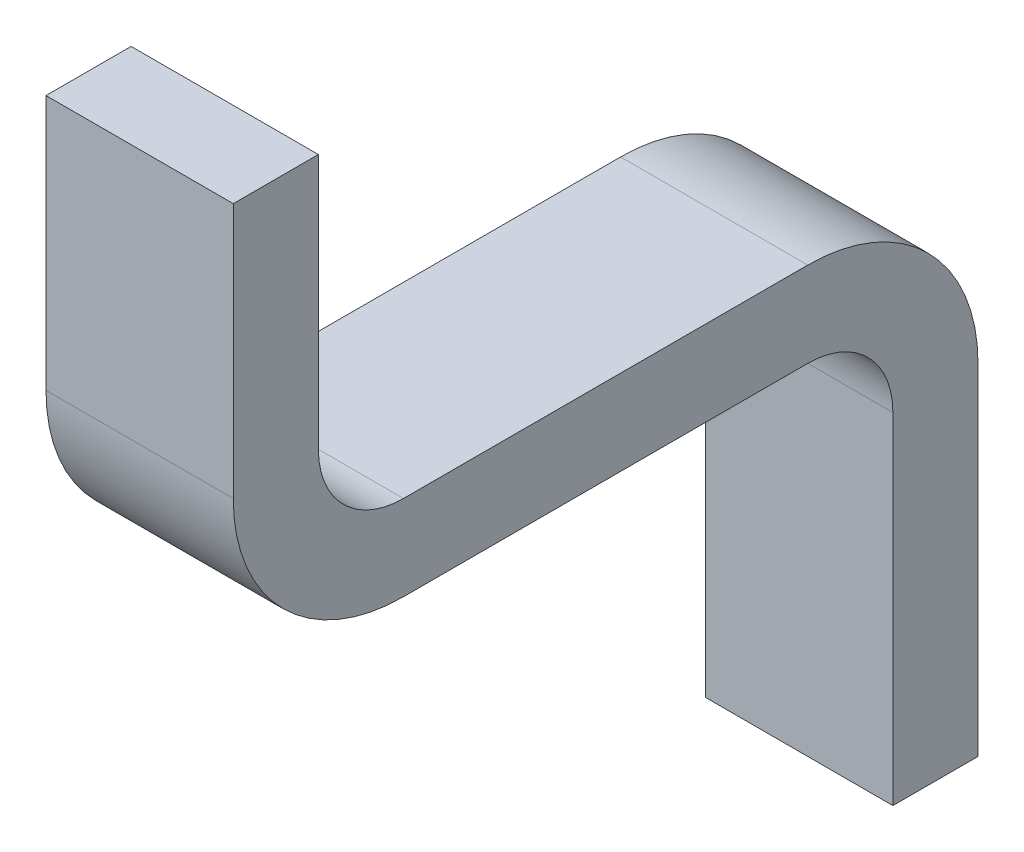
ISO-10303-21;
HEADER;
FILE_DESCRIPTION(('STEP AP214'),'2;1');
FILE_NAME('part.step','',(''),(''),'','','');
FILE_SCHEMA(('AUTOMOTIVE_DESIGN { 1 0 10303 214 1 1 1 1 }'));
ENDSEC;
DATA;
#1=APPLICATION_CONTEXT('core data for automotive mechanical design processes');
#2=APPLICATION_PROTOCOL_DEFINITION('international standard','automotive_design',2000,#1);
#3=PRODUCT_CONTEXT('',#1,'mechanical');
#4=PRODUCT('Part','Part','',(#3));
#5=PRODUCT_RELATED_PRODUCT_CATEGORY('part','',(#4));
#6=PRODUCT_DEFINITION_FORMATION('','',#4);
#7=PRODUCT_DEFINITION_CONTEXT('part definition',#1,'design');
#8=PRODUCT_DEFINITION('design','',#6,#7);
#9=PRODUCT_DEFINITION_SHAPE('','',#8);
#10=(LENGTH_UNIT() NAMED_UNIT(*) SI_UNIT(.MILLI.,.METRE.));
#11=(NAMED_UNIT(*) PLANE_ANGLE_UNIT() SI_UNIT($,.RADIAN.));
#12=(NAMED_UNIT(*) SI_UNIT($,.STERADIAN.) SOLID_ANGLE_UNIT());
#13=UNCERTAINTY_MEASURE_WITH_UNIT(LENGTH_MEASURE(1.E-05),#10,'distance_accuracy_value','');
#14=(GEOMETRIC_REPRESENTATION_CONTEXT(3) GLOBAL_UNCERTAINTY_ASSIGNED_CONTEXT((#13)) GLOBAL_UNIT_ASSIGNED_CONTEXT((#10,
#11,#12)) REPRESENTATION_CONTEXT('',''));
#15=CARTESIAN_POINT('',(0.,0.,0.));
#16=DIRECTION('',(0.,0.,1.));
#17=DIRECTION('',(1.,0.,0.));
#18=AXIS2_PLACEMENT_3D('',#15,#16,#17);
#19=CARTESIAN_POINT('',(-2.86,-4.,0.675));
#20=DIRECTION('',(1.,0.,0.));
#21=DIRECTION('',(0.,1.,0.));
#22=AXIS2_PLACEMENT_3D('',#19,#20,#21);
#23=PLANE('',#22);
#24=CARTESIAN_POINT('',(-2.86,-3.8,0.675));
#25=DIRECTION('',(-1.,0.,0.));
#26=DIRECTION('',(0.,-1.,0.));
#27=AXIS2_PLACEMENT_3D('',#24,#25,#26);
#28=CIRCLE('',#27,0.2);
#29=CARTESIAN_POINT('',(-2.86,-3.8,0.875));
#30=VERTEX_POINT('',#29);
#31=CARTESIAN_POINT('',(-2.86,-4.,0.675));
#32=VERTEX_POINT('',#31);
#33=EDGE_CURVE('E150',#30,#32,#28,.F.);
#34=ORIENTED_EDGE('',*,*,#33,.F.);
#35=DIRECTION('',(0.,1.,0.));
#36=VECTOR('',#35,1.);
#37=CARTESIAN_POINT('',(-2.86,-3.5,0.875));
#38=LINE('',#37,#36);
#39=CARTESIAN_POINT('',(-2.86,-3.5,0.875));
#40=VERTEX_POINT('',#39);
#41=EDGE_CURVE('E147',#30,#40,#38,.T.);
#42=ORIENTED_EDGE('',*,*,#41,.T.);
#43=DIRECTION('',(0.,0.,1.));
#44=VECTOR('',#43,1.);
#45=CARTESIAN_POINT('',(-2.86,-3.5,0.775));
#46=LINE('',#45,#44);
#47=CARTESIAN_POINT('',(-2.86,-3.5,0.775));
#48=VERTEX_POINT('',#47);
#49=EDGE_CURVE('E141',#48,#40,#46,.T.);
#50=ORIENTED_EDGE('',*,*,#49,.F.);
#51=DIRECTION('',(0.,1.,0.));
#52=VECTOR('',#51,1.);
#53=CARTESIAN_POINT('',(-2.86,-3.5,0.775));
#54=LINE('',#53,#52);
#55=CARTESIAN_POINT('',(-2.86,-3.8,0.775));
#56=VERTEX_POINT('',#55);
#57=EDGE_CURVE('E115',#48,#56,#54,.F.);
#58=ORIENTED_EDGE('',*,*,#57,.T.);
#59=CARTESIAN_POINT('',(-2.86,-3.8,0.675));
#60=DIRECTION('',(-1.,0.,0.));
#61=DIRECTION('',(0.,-1.,0.));
#62=AXIS2_PLACEMENT_3D('',#59,#60,#61);
#63=CIRCLE('',#62,0.1);
#64=CARTESIAN_POINT('',(-2.86,-3.9,0.675));
#65=VERTEX_POINT('',#64);
#66=EDGE_CURVE('E215',#56,#65,#63,.F.);
#67=ORIENTED_EDGE('',*,*,#66,.T.);
#68=DIRECTION('',(0.,0.,1.));
#69=VECTOR('',#68,1.);
#70=CARTESIAN_POINT('',(-2.86,-3.9,0.675));
#71=LINE('',#70,#69);
#72=CARTESIAN_POINT('',(-2.86,-3.9,0.2));
#73=VERTEX_POINT('',#72);
#74=EDGE_CURVE('E181',#65,#73,#71,.F.);
#75=ORIENTED_EDGE('',*,*,#74,.T.);
#76=CARTESIAN_POINT('',(-2.86,-4.1,0.2));
#77=DIRECTION('',(1.,0.,0.));
#78=DIRECTION('',(0.,1.,0.));
#79=AXIS2_PLACEMENT_3D('',#76,#77,#78);
#80=CIRCLE('',#79,0.2);
#81=CARTESIAN_POINT('',(-2.86,-4.1,0.));
#82=VERTEX_POINT('',#81);
#83=EDGE_CURVE('E20',#82,#73,#80,.T.);
#84=ORIENTED_EDGE('',*,*,#83,.F.);
#85=DIRECTION('',(0.,1.,0.));
#86=VECTOR('',#85,1.);
#87=CARTESIAN_POINT('',(-2.86,-4.1,0.));
#88=LINE('',#87,#86);
#89=CARTESIAN_POINT('',(-2.86,-4.5,0.));
#90=VERTEX_POINT('',#89);
#91=EDGE_CURVE('E91',#82,#90,#88,.F.);
#92=ORIENTED_EDGE('',*,*,#91,.T.);
#93=DIRECTION('',(0.,0.,1.));
#94=VECTOR('',#93,1.);
#95=CARTESIAN_POINT('',(-2.86,-4.5,0.));
#96=LINE('',#95,#94);
#97=CARTESIAN_POINT('',(-2.86,-4.5,0.1));
#98=VERTEX_POINT('',#97);
#99=EDGE_CURVE('E163',#90,#98,#96,.T.);
#100=ORIENTED_EDGE('',*,*,#99,.T.);
#101=DIRECTION('',(0.,1.,0.));
#102=VECTOR('',#101,1.);
#103=CARTESIAN_POINT('',(-2.86,-4.1,0.1));
#104=LINE('',#103,#102);
#105=CARTESIAN_POINT('',(-2.86,-4.1,0.1));
#106=VERTEX_POINT('',#105);
#107=EDGE_CURVE('E159',#98,#106,#104,.T.);
#108=ORIENTED_EDGE('',*,*,#107,.T.);
#109=CARTESIAN_POINT('',(-2.86,-4.1,0.2));
#110=DIRECTION('',(1.,0.,0.));
#111=DIRECTION('',(0.,1.,0.));
#112=AXIS2_PLACEMENT_3D('',#109,#110,#111);
#113=CIRCLE('',#112,0.1);
#114=CARTESIAN_POINT('',(-2.86,-4.,0.2));
#115=VERTEX_POINT('',#114);
#116=EDGE_CURVE('E155',#106,#115,#113,.T.);
#117=ORIENTED_EDGE('',*,*,#116,.T.);
#118=DIRECTION('',(0.,0.,1.));
#119=VECTOR('',#118,1.);
#120=CARTESIAN_POINT('',(-2.86,-4.,0.675));
#121=LINE('',#120,#119);
#122=EDGE_CURVE('E154',#115,#32,#121,.T.);
#123=ORIENTED_EDGE('',*,*,#122,.T.);
#124=EDGE_LOOP('',(#34,#42,#50,#58,#67,#75,#84,#92,#100,#108,#117,#123));
#125=FACE_BOUND('',#124,.T.);
#126=ADVANCED_FACE('F17',(#125),#23,.F.);
#127=CARTESIAN_POINT('',(-2.86,-4.1,0.2));
#128=DIRECTION('',(1.,0.,0.));
#129=DIRECTION('',(0.,1.,0.));
#130=AXIS2_PLACEMENT_3D('',#127,#128,#129);
#131=CYLINDRICAL_SURFACE('',#130,0.2);
#132=CARTESIAN_POINT('',(-2.64,-4.1,0.2));
#133=DIRECTION('',(1.,0.,0.));
#134=DIRECTION('',(0.,1.,0.));
#135=AXIS2_PLACEMENT_3D('',#132,#133,#134);
#136=CIRCLE('',#135,0.2);
#137=CARTESIAN_POINT('',(-2.64,-3.9,0.2));
#138=VERTEX_POINT('',#137);
#139=CARTESIAN_POINT('',(-2.64,-4.1,0.));
#140=VERTEX_POINT('',#139);
#141=EDGE_CURVE('E183',#138,#140,#136,.F.);
#142=ORIENTED_EDGE('',*,*,#141,.T.);
#143=DIRECTION('',(1.,0.,0.));
#144=VECTOR('',#143,1.);
#145=CARTESIAN_POINT('',(-2.86,-4.1,0.));
#146=LINE('',#145,#144);
#147=EDGE_CURVE('E178',#140,#82,#146,.F.);
#148=ORIENTED_EDGE('',*,*,#147,.T.);
#149=ORIENTED_EDGE('',*,*,#83,.T.);
#150=DIRECTION('',(1.,0.,0.));
#151=VECTOR('',#150,1.);
#152=CARTESIAN_POINT('',(-2.86,-3.9,0.2));
#153=LINE('',#152,#151);
#154=EDGE_CURVE('E217',#73,#138,#153,.T.);
#155=ORIENTED_EDGE('',*,*,#154,.T.);
#156=EDGE_LOOP('',(#142,#148,#149,#155));
#157=FACE_BOUND('',#156,.T.);
#158=ADVANCED_FACE('F254',(#157),#131,.T.);
#159=CARTESIAN_POINT('',(-2.86,-4.1,0.));
#160=DIRECTION('',(0.,0.,1.));
#161=DIRECTION('',(1.,0.,0.));
#162=AXIS2_PLACEMENT_3D('',#159,#160,#161);
#163=PLANE('',#162);
#164=ORIENTED_EDGE('',*,*,#147,.F.);
#165=DIRECTION('',(0.,-1.,0.));
#166=VECTOR('',#165,1.);
#167=CARTESIAN_POINT('',(-2.64,-3.9,0.));
#168=LINE('',#167,#166);
#169=CARTESIAN_POINT('',(-2.64,-4.5,0.));
#170=VERTEX_POINT('',#169);
#171=EDGE_CURVE('E170',#140,#170,#168,.T.);
#172=ORIENTED_EDGE('',*,*,#171,.T.);
#173=DIRECTION('',(-1.,0.,0.));
#174=VECTOR('',#173,1.);
#175=CARTESIAN_POINT('',(-2.86,-4.5,0.));
#176=LINE('',#175,#174);
#177=EDGE_CURVE('E173',#170,#90,#176,.T.);
#178=ORIENTED_EDGE('',*,*,#177,.T.);
#179=ORIENTED_EDGE('',*,*,#91,.F.);
#180=EDGE_LOOP('',(#164,#172,#178,#179));
#181=FACE_BOUND('',#180,.T.);
#182=ADVANCED_FACE('F257',(#181),#163,.F.);
#183=CARTESIAN_POINT('',(-2.86,-4.5,0.));
#184=DIRECTION('',(0.,1.,0.));
#185=DIRECTION('',(-1.,0.,0.));
#186=AXIS2_PLACEMENT_3D('',#183,#184,#185);
#187=PLANE('',#186);
#188=DIRECTION('',(-1.,0.,0.));
#189=VECTOR('',#188,1.);
#190=CARTESIAN_POINT('',(-2.64,-4.5,0.1));
#191=LINE('',#190,#189);
#192=CARTESIAN_POINT('',(-2.64,-4.5,0.1));
#193=VERTEX_POINT('',#192);
#194=EDGE_CURVE('E160',#193,#98,#191,.T.);
#195=ORIENTED_EDGE('',*,*,#194,.T.);
#196=ORIENTED_EDGE('',*,*,#99,.F.);
#197=ORIENTED_EDGE('',*,*,#177,.F.);
#198=DIRECTION('',(0.,0.,1.));
#199=VECTOR('',#198,1.);
#200=CARTESIAN_POINT('',(-2.64,-4.5,0.675));
#201=LINE('',#200,#199);
#202=EDGE_CURVE('E166',#170,#193,#201,.T.);
#203=ORIENTED_EDGE('',*,*,#202,.T.);
#204=EDGE_LOOP('',(#195,#196,#197,#203));
#205=FACE_BOUND('',#204,.T.);
#206=ADVANCED_FACE('F259',(#205),#187,.F.);
#207=CARTESIAN_POINT('',(-2.64,-4.1,0.1));
#208=DIRECTION('',(0.,0.,-1.));
#209=DIRECTION('',(-1.,0.,0.));
#210=AXIS2_PLACEMENT_3D('',#207,#208,#209);
#211=PLANE('',#210);
#212=DIRECTION('',(1.,0.,0.));
#213=VECTOR('',#212,1.);
#214=CARTESIAN_POINT('',(-2.64,-4.1,0.1));
#215=LINE('',#214,#213);
#216=CARTESIAN_POINT('',(-2.64,-4.1,0.1));
#217=VERTEX_POINT('',#216);
#218=EDGE_CURVE('E156',#217,#106,#215,.F.);
#219=ORIENTED_EDGE('',*,*,#218,.T.);
#220=ORIENTED_EDGE('',*,*,#107,.F.);
#221=ORIENTED_EDGE('',*,*,#194,.F.);
#222=DIRECTION('',(0.,-1.,0.));
#223=VECTOR('',#222,1.);
#224=CARTESIAN_POINT('',(-2.64,-3.9,0.1));
#225=LINE('',#224,#223);
#226=EDGE_CURVE('E169',#193,#217,#225,.F.);
#227=ORIENTED_EDGE('',*,*,#226,.T.);
#228=EDGE_LOOP('',(#219,#220,#221,#227));
#229=FACE_BOUND('',#228,.T.);
#230=ADVANCED_FACE('F234',(#229),#211,.F.);
#231=CARTESIAN_POINT('',(-2.64,-4.1,0.2));
#232=DIRECTION('',(1.,0.,0.));
#233=DIRECTION('',(0.,1.,0.));
#234=AXIS2_PLACEMENT_3D('',#231,#232,#233);
#235=CYLINDRICAL_SURFACE('',#234,0.1);
#236=DIRECTION('',(-1.,0.,0.));
#237=VECTOR('',#236,1.);
#238=CARTESIAN_POINT('',(-2.64,-4.,0.2));
#239=LINE('',#238,#237);
#240=CARTESIAN_POINT('',(-2.64,-4.,0.2));
#241=VERTEX_POINT('',#240);
#242=EDGE_CURVE('E151',#241,#115,#239,.T.);
#243=ORIENTED_EDGE('',*,*,#242,.T.);
#244=ORIENTED_EDGE('',*,*,#116,.F.);
#245=ORIENTED_EDGE('',*,*,#218,.F.);
#246=CARTESIAN_POINT('',(-2.64,-4.1,0.2));
#247=DIRECTION('',(1.,0.,0.));
#248=DIRECTION('',(0.,1.,0.));
#249=AXIS2_PLACEMENT_3D('',#246,#247,#248);
#250=CIRCLE('',#249,0.1);
#251=EDGE_CURVE('E210',#217,#241,#250,.T.);
#252=ORIENTED_EDGE('',*,*,#251,.T.);
#253=EDGE_LOOP('',(#243,#244,#245,#252));
#254=FACE_BOUND('',#253,.T.);
#255=ADVANCED_FACE('F227',(#254),#235,.F.);
#256=CARTESIAN_POINT('',(-2.64,-4.,0.675));
#257=DIRECTION('',(0.,1.,0.));
#258=DIRECTION('',(-1.,0.,0.));
#259=AXIS2_PLACEMENT_3D('',#256,#257,#258);
#260=PLANE('',#259);
#261=DIRECTION('',(-1.,0.,0.));
#262=VECTOR('',#261,1.);
#263=CARTESIAN_POINT('',(-2.64,-4.,0.675));
#264=LINE('',#263,#262);
#265=CARTESIAN_POINT('',(-2.64,-4.,0.675));
#266=VERTEX_POINT('',#265);
#267=EDGE_CURVE('E148',#32,#266,#264,.F.);
#268=ORIENTED_EDGE('',*,*,#267,.F.);
#269=ORIENTED_EDGE('',*,*,#122,.F.);
#270=ORIENTED_EDGE('',*,*,#242,.F.);
#271=DIRECTION('',(0.,0.,1.));
#272=VECTOR('',#271,1.);
#273=CARTESIAN_POINT('',(-2.64,-4.,0.675));
#274=LINE('',#273,#272);
#275=EDGE_CURVE('E209',#241,#266,#274,.T.);
#276=ORIENTED_EDGE('',*,*,#275,.T.);
#277=EDGE_LOOP('',(#268,#269,#270,#276));
#278=FACE_BOUND('',#277,.T.);
#279=ADVANCED_FACE('F224',(#278),#260,.F.);
#280=CARTESIAN_POINT('',(-2.64000000000001,-3.80000000000001,0.675));
#281=DIRECTION('',(-1.,0.,0.));
#282=DIRECTION('',(0.,-1.,0.));
#283=AXIS2_PLACEMENT_3D('',#280,#281,#282);
#284=CYLINDRICAL_SURFACE('',#283,0.2);
#285=ORIENTED_EDGE('',*,*,#33,.T.);
#286=ORIENTED_EDGE('',*,*,#267,.T.);
#287=CARTESIAN_POINT('',(-2.64000000000001,-3.80000000000001,0.675));
#288=DIRECTION('',(-1.,0.,0.));
#289=DIRECTION('',(0.,-1.,0.));
#290=AXIS2_PLACEMENT_3D('',#287,#288,#289);
#291=CIRCLE('',#290,0.2);
#292=CARTESIAN_POINT('',(-2.64000000000001,-3.80000000000001,0.875));
#293=VERTEX_POINT('',#292);
#294=EDGE_CURVE('E133',#266,#293,#291,.T.);
#295=ORIENTED_EDGE('',*,*,#294,.T.);
#296=DIRECTION('',(-1.,0.,0.));
#297=VECTOR('',#296,1.);
#298=CARTESIAN_POINT('',(-2.64000000000001,-3.80000000000001,0.875));
#299=LINE('',#298,#297);
#300=EDGE_CURVE('E144',#293,#30,#299,.T.);
#301=ORIENTED_EDGE('',*,*,#300,.T.);
#302=EDGE_LOOP('',(#285,#286,#295,#301));
#303=FACE_BOUND('',#302,.T.);
#304=ADVANCED_FACE('F285',(#303),#284,.T.);
#305=CARTESIAN_POINT('',(-2.64,-3.5,0.875));
#306=DIRECTION('',(0.,0.,-1.));
#307=DIRECTION('',(-1.,0.,0.));
#308=AXIS2_PLACEMENT_3D('',#305,#306,#307);
#309=PLANE('',#308);
#310=DIRECTION('',(-1.,0.,0.));
#311=VECTOR('',#310,1.);
#312=CARTESIAN_POINT('',(-2.86,-3.5,0.875));
#313=LINE('',#312,#311);
#314=CARTESIAN_POINT('',(-2.64,-3.5,0.875));
#315=VERTEX_POINT('',#314);
#316=EDGE_CURVE('E118',#40,#315,#313,.F.);
#317=ORIENTED_EDGE('',*,*,#316,.F.);
#318=ORIENTED_EDGE('',*,*,#41,.F.);
#319=ORIENTED_EDGE('',*,*,#300,.F.);
#320=DIRECTION('',(0.,-1.,0.));
#321=VECTOR('',#320,1.);
#322=CARTESIAN_POINT('',(-2.64,-3.9,0.875));
#323=LINE('',#322,#321);
#324=EDGE_CURVE('E131',#293,#315,#323,.F.);
#325=ORIENTED_EDGE('',*,*,#324,.T.);
#326=EDGE_LOOP('',(#317,#318,#319,#325));
#327=FACE_BOUND('',#326,.T.);
#328=ADVANCED_FACE('F282',(#327),#309,.F.);
#329=CARTESIAN_POINT('',(-2.86,-3.5,0.775));
#330=DIRECTION('',(0.,1.,0.));
#331=DIRECTION('',(-1.,0.,0.));
#332=AXIS2_PLACEMENT_3D('',#329,#330,#331);
#333=PLANE('',#332);
#334=ORIENTED_EDGE('',*,*,#49,.T.);
#335=ORIENTED_EDGE('',*,*,#316,.T.);
#336=DIRECTION('',(0.,0.,1.));
#337=VECTOR('',#336,1.);
#338=CARTESIAN_POINT('',(-2.64,-3.5,0.675));
#339=LINE('',#338,#337);
#340=CARTESIAN_POINT('',(-2.64,-3.5,0.775));
#341=VERTEX_POINT('',#340);
#342=EDGE_CURVE('E125',#315,#341,#339,.F.);
#343=ORIENTED_EDGE('',*,*,#342,.T.);
#344=DIRECTION('',(1.,0.,0.));
#345=VECTOR('',#344,1.);
#346=CARTESIAN_POINT('',(-2.86,-3.5,0.775));
#347=LINE('',#346,#345);
#348=EDGE_CURVE('E110',#341,#48,#347,.F.);
#349=ORIENTED_EDGE('',*,*,#348,.T.);
#350=EDGE_LOOP('',(#334,#335,#343,#349));
#351=FACE_BOUND('',#350,.T.);
#352=ADVANCED_FACE('F129',(#351),#333,.T.);
#353=CARTESIAN_POINT('',(-2.86,-3.5,0.775));
#354=DIRECTION('',(0.,0.,1.));
#355=DIRECTION('',(1.,0.,0.));
#356=AXIS2_PLACEMENT_3D('',#353,#354,#355);
#357=PLANE('',#356);
#358=ORIENTED_EDGE('',*,*,#348,.F.);
#359=DIRECTION('',(0.,-1.,0.));
#360=VECTOR('',#359,1.);
#361=CARTESIAN_POINT('',(-2.64,-3.9,0.775));
#362=LINE('',#361,#360);
#363=CARTESIAN_POINT('',(-2.64000000000001,-3.80000000000001,0.775));
#364=VERTEX_POINT('',#363);
#365=EDGE_CURVE('E114',#341,#364,#362,.T.);
#366=ORIENTED_EDGE('',*,*,#365,.T.);
#367=DIRECTION('',(-1.,0.,0.));
#368=VECTOR('',#367,1.);
#369=CARTESIAN_POINT('',(-2.86,-3.8,0.775));
#370=LINE('',#369,#368);
#371=EDGE_CURVE('E185',#364,#56,#370,.T.);
#372=ORIENTED_EDGE('',*,*,#371,.T.);
#373=ORIENTED_EDGE('',*,*,#57,.F.);
#374=EDGE_LOOP('',(#358,#366,#372,#373));
#375=FACE_BOUND('',#374,.T.);
#376=ADVANCED_FACE('F112',(#375),#357,.F.);
#377=CARTESIAN_POINT('',(-2.86,-3.8,0.675));
#378=DIRECTION('',(-1.,0.,0.));
#379=DIRECTION('',(0.,-1.,0.));
#380=AXIS2_PLACEMENT_3D('',#377,#378,#379);
#381=CYLINDRICAL_SURFACE('',#380,0.1);
#382=ORIENTED_EDGE('',*,*,#371,.F.);
#383=CARTESIAN_POINT('',(-2.64000000000001,-3.80000000000001,0.675));
#384=DIRECTION('',(-1.,0.,0.));
#385=DIRECTION('',(0.,-1.,0.));
#386=AXIS2_PLACEMENT_3D('',#383,#384,#385);
#387=CIRCLE('',#386,0.1);
#388=CARTESIAN_POINT('',(-2.64,-3.9,0.675));
#389=VERTEX_POINT('',#388);
#390=EDGE_CURVE('E26',#364,#389,#387,.F.);
#391=ORIENTED_EDGE('',*,*,#390,.T.);
#392=DIRECTION('',(1.,0.,0.));
#393=VECTOR('',#392,1.);
#394=CARTESIAN_POINT('',(-2.86,-3.9,0.675));
#395=LINE('',#394,#393);
#396=EDGE_CURVE('E34',#389,#65,#395,.F.);
#397=ORIENTED_EDGE('',*,*,#396,.T.);
#398=ORIENTED_EDGE('',*,*,#66,.F.);
#399=EDGE_LOOP('',(#382,#391,#397,#398));
#400=FACE_BOUND('',#399,.T.);
#401=ADVANCED_FACE('F250',(#400),#381,.F.);
#402=CARTESIAN_POINT('',(-2.86,-3.9,0.675));
#403=DIRECTION('',(0.,-1.,0.));
#404=DIRECTION('',(1.,0.,0.));
#405=AXIS2_PLACEMENT_3D('',#402,#403,#404);
#406=PLANE('',#405);
#407=ORIENTED_EDGE('',*,*,#396,.F.);
#408=DIRECTION('',(0.,0.,1.));
#409=VECTOR('',#408,1.);
#410=CARTESIAN_POINT('',(-2.64,-3.9,0.675));
#411=LINE('',#410,#409);
#412=EDGE_CURVE('E11',#389,#138,#411,.F.);
#413=ORIENTED_EDGE('',*,*,#412,.T.);
#414=ORIENTED_EDGE('',*,*,#154,.F.);
#415=ORIENTED_EDGE('',*,*,#74,.F.);
#416=EDGE_LOOP('',(#407,#413,#414,#415));
#417=FACE_BOUND('',#416,.T.);
#418=ADVANCED_FACE('F252',(#417),#406,.F.);
#419=CARTESIAN_POINT('',(-2.64,-3.9,0.675));
#420=DIRECTION('',(-1.,0.,0.));
#421=DIRECTION('',(0.,-1.,0.));
#422=AXIS2_PLACEMENT_3D('',#419,#420,#421);
#423=PLANE('',#422);
#424=ORIENTED_EDGE('',*,*,#390,.F.);
#425=ORIENTED_EDGE('',*,*,#365,.F.);
#426=ORIENTED_EDGE('',*,*,#342,.F.);
#427=ORIENTED_EDGE('',*,*,#324,.F.);
#428=ORIENTED_EDGE('',*,*,#294,.F.);
#429=ORIENTED_EDGE('',*,*,#275,.F.);
#430=ORIENTED_EDGE('',*,*,#251,.F.);
#431=ORIENTED_EDGE('',*,*,#226,.F.);
#432=ORIENTED_EDGE('',*,*,#202,.F.);
#433=ORIENTED_EDGE('',*,*,#171,.F.);
#434=ORIENTED_EDGE('',*,*,#141,.F.);
#435=ORIENTED_EDGE('',*,*,#412,.F.);
#436=EDGE_LOOP('',(#424,#425,#426,#427,#428,#429,#430,#431,#432,#433,#434,#435));
#437=FACE_BOUND('',#436,.T.);
#438=ADVANCED_FACE('F123',(#437),#423,.F.);
#439=CLOSED_SHELL('',(#126,#158,#182,#206,#230,#255,#279,#304,#328,#352,#376,#401,#418,#438));
#440=MANIFOLD_SOLID_BREP('B1',#439);
#441=ADVANCED_BREP_SHAPE_REPRESENTATION('',(#18,#440),#14);
#442=SHAPE_DEFINITION_REPRESENTATION(#9,#441);
ENDSEC;
END-ISO-10303-21;
